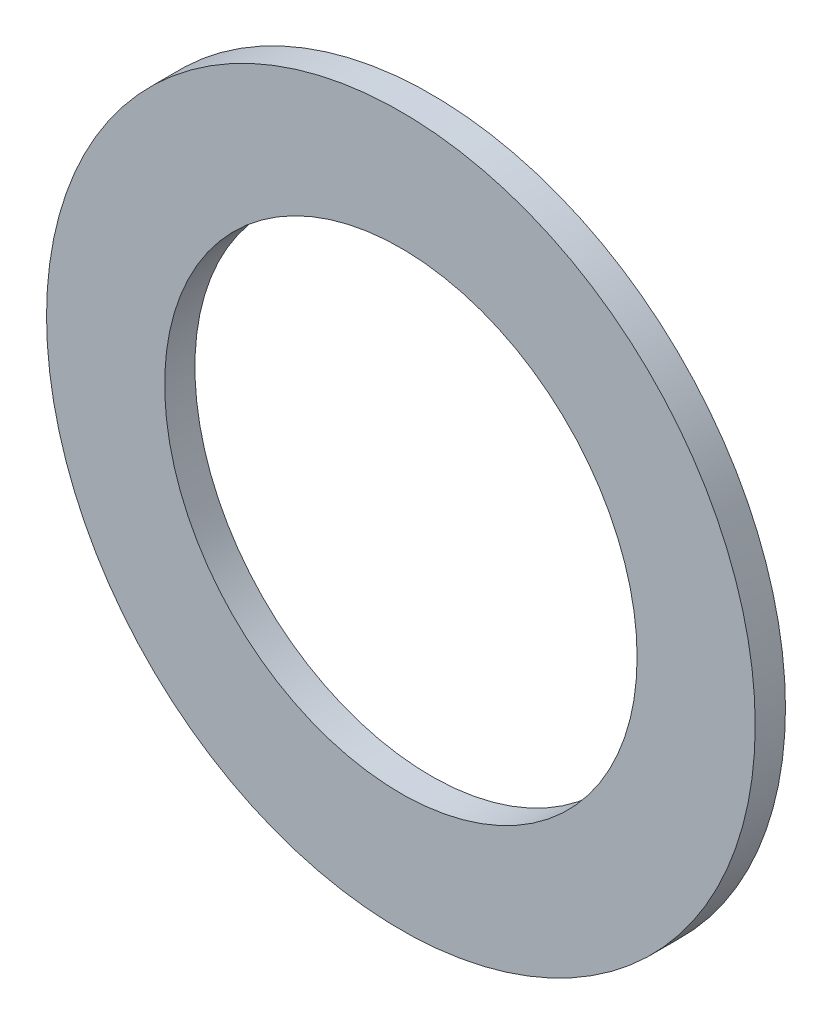
ISO-10303-21;
HEADER;
FILE_DESCRIPTION(('STEP AP214'),'2;1');
FILE_NAME('part.step','',(''),(''),'','','');
FILE_SCHEMA(('AUTOMOTIVE_DESIGN { 1 0 10303 214 1 1 1 1 }'));
ENDSEC;
DATA;
#1=APPLICATION_CONTEXT('core data for automotive mechanical design processes');
#2=APPLICATION_PROTOCOL_DEFINITION('international standard','automotive_design',2000,#1);
#3=PRODUCT_CONTEXT('',#1,'mechanical');
#4=PRODUCT('Part','Part','',(#3));
#5=PRODUCT_RELATED_PRODUCT_CATEGORY('part','',(#4));
#6=PRODUCT_DEFINITION_FORMATION('','',#4);
#7=PRODUCT_DEFINITION_CONTEXT('part definition',#1,'design');
#8=PRODUCT_DEFINITION('design','',#6,#7);
#9=PRODUCT_DEFINITION_SHAPE('','',#8);
#10=(LENGTH_UNIT() NAMED_UNIT(*) SI_UNIT(.MILLI.,.METRE.));
#11=(NAMED_UNIT(*) PLANE_ANGLE_UNIT() SI_UNIT($,.RADIAN.));
#12=(NAMED_UNIT(*) SI_UNIT($,.STERADIAN.) SOLID_ANGLE_UNIT());
#13=UNCERTAINTY_MEASURE_WITH_UNIT(LENGTH_MEASURE(1.E-05),#10,'distance_accuracy_value','');
#14=(GEOMETRIC_REPRESENTATION_CONTEXT(3) GLOBAL_UNCERTAINTY_ASSIGNED_CONTEXT((#13)) GLOBAL_UNIT_ASSIGNED_CONTEXT((#10,
#11,#12)) REPRESENTATION_CONTEXT('',''));
#15=CARTESIAN_POINT('',(0.,0.,0.));
#16=DIRECTION('',(0.,0.,1.));
#17=DIRECTION('',(1.,0.,0.));
#18=AXIS2_PLACEMENT_3D('',#15,#16,#17);
#19=CARTESIAN_POINT('',(0.,0.,0.8128));
#20=DIRECTION('',(0.,0.,1.));
#21=DIRECTION('',(1.,0.,0.));
#22=AXIS2_PLACEMENT_3D('',#19,#20,#21);
#23=PLANE('',#22);
#24=CARTESIAN_POINT('',(0.,0.,0.8128));
#25=DIRECTION('',(0.,0.,1.));
#26=DIRECTION('',(1.,0.,0.));
#27=AXIS2_PLACEMENT_3D('',#24,#25,#26);
#28=CIRCLE('',#27,9.525);
#29=CARTESIAN_POINT('',(9.525,0.,0.8128));
#30=VERTEX_POINT('',#29);
#31=EDGE_CURVE('E10',#30,#30,#28,.T.);
#32=ORIENTED_EDGE('',*,*,#31,.T.);
#33=EDGE_LOOP('',(#32));
#34=FACE_BOUND('',#33,.T.);
#35=CARTESIAN_POINT('',(0.,0.,0.8128));
#36=DIRECTION('',(0.,0.,1.));
#37=DIRECTION('',(1.,0.,0.));
#38=AXIS2_PLACEMENT_3D('',#35,#36,#37);
#39=CIRCLE('',#38,6.35);
#40=CARTESIAN_POINT('',(6.35,0.,0.8128));
#41=VERTEX_POINT('',#40);
#42=EDGE_CURVE('E42',#41,#41,#39,.T.);
#43=ORIENTED_EDGE('',*,*,#42,.F.);
#44=EDGE_LOOP('',(#43));
#45=FACE_BOUND('',#44,.T.);
#46=ADVANCED_FACE('F31',(#34,#45),#23,.T.);
#47=CARTESIAN_POINT('',(0.,0.,0.));
#48=DIRECTION('',(0.,0.,1.));
#49=DIRECTION('',(1.,0.,0.));
#50=AXIS2_PLACEMENT_3D('',#47,#48,#49);
#51=PLANE('',#50);
#52=CARTESIAN_POINT('',(0.,0.,0.));
#53=DIRECTION('',(0.,0.,1.));
#54=DIRECTION('',(1.,0.,0.));
#55=AXIS2_PLACEMENT_3D('',#52,#53,#54);
#56=CIRCLE('',#55,9.525);
#57=CARTESIAN_POINT('',(9.525,0.,0.));
#58=VERTEX_POINT('',#57);
#59=EDGE_CURVE('E35',#58,#58,#56,.T.);
#60=ORIENTED_EDGE('',*,*,#59,.F.);
#61=EDGE_LOOP('',(#60));
#62=FACE_BOUND('',#61,.T.);
#63=CARTESIAN_POINT('',(0.,0.,0.));
#64=DIRECTION('',(0.,0.,1.));
#65=DIRECTION('',(1.,0.,0.));
#66=AXIS2_PLACEMENT_3D('',#63,#64,#65);
#67=CIRCLE('',#66,6.35);
#68=CARTESIAN_POINT('',(6.35,0.,0.));
#69=VERTEX_POINT('',#68);
#70=EDGE_CURVE('E44',#69,#69,#67,.T.);
#71=ORIENTED_EDGE('',*,*,#70,.T.);
#72=EDGE_LOOP('',(#71));
#73=FACE_BOUND('',#72,.T.);
#74=ADVANCED_FACE('F54',(#62,#73),#51,.F.);
#75=CARTESIAN_POINT('',(0.,0.,0.8128));
#76=DIRECTION('',(0.,0.,-1.));
#77=DIRECTION('',(-1.,0.,0.));
#78=AXIS2_PLACEMENT_3D('',#75,#76,#77);
#79=CYLINDRICAL_SURFACE('',#78,9.525);
#80=ORIENTED_EDGE('',*,*,#31,.F.);
#81=EDGE_LOOP('',(#80));
#82=FACE_BOUND('',#81,.T.);
#83=ORIENTED_EDGE('',*,*,#59,.T.);
#84=EDGE_LOOP('',(#83));
#85=FACE_BOUND('',#84,.T.);
#86=ADVANCED_FACE('F33',(#82,#85),#79,.T.);
#87=CARTESIAN_POINT('',(0.,0.,0.8128));
#88=DIRECTION('',(0.,0.,-1.));
#89=DIRECTION('',(-1.,0.,0.));
#90=AXIS2_PLACEMENT_3D('',#87,#88,#89);
#91=CYLINDRICAL_SURFACE('',#90,6.35);
#92=ORIENTED_EDGE('',*,*,#42,.T.);
#93=EDGE_LOOP('',(#92));
#94=FACE_BOUND('',#93,.T.);
#95=ORIENTED_EDGE('',*,*,#70,.F.);
#96=EDGE_LOOP('',(#95));
#97=FACE_BOUND('',#96,.T.);
#98=ADVANCED_FACE('F50',(#94,#97),#91,.F.);
#99=CLOSED_SHELL('',(#46,#74,#86,#98));
#100=MANIFOLD_SOLID_BREP('B2',#99);
#101=ADVANCED_BREP_SHAPE_REPRESENTATION('',(#18,#100),#14);
#102=SHAPE_DEFINITION_REPRESENTATION(#9,#101);
ENDSEC;
END-ISO-10303-21;
